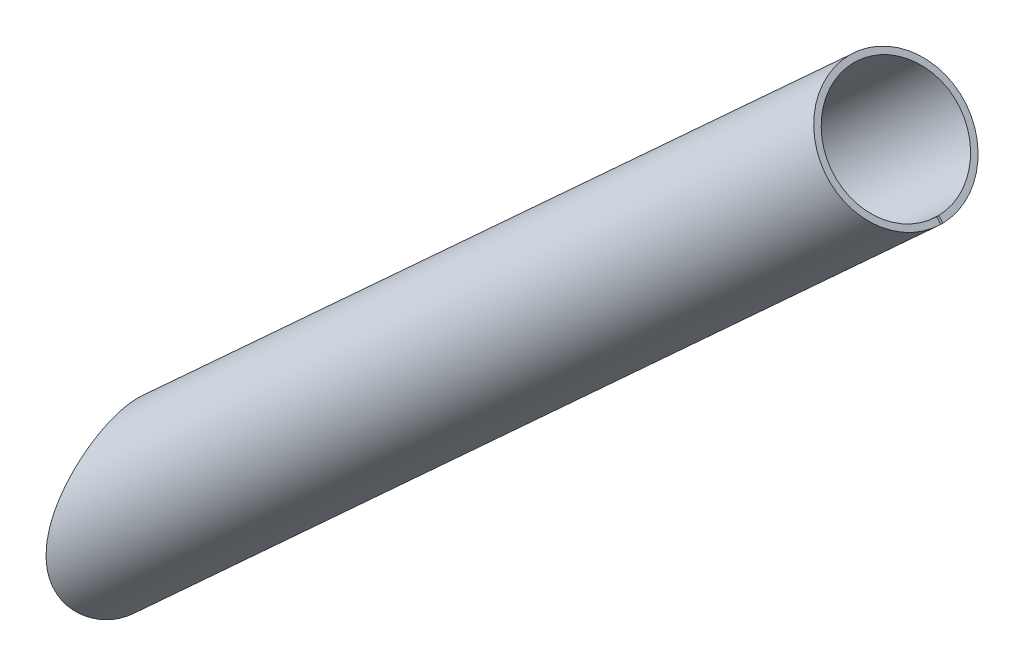
ISO-10303-21;
HEADER;
FILE_DESCRIPTION(('STEP AP214'),'2;1');
FILE_NAME('part.step','',(''),(''),'','','');
FILE_SCHEMA(('AUTOMOTIVE_DESIGN { 1 0 10303 214 1 1 1 1 }'));
ENDSEC;
DATA;
#1=APPLICATION_CONTEXT('core data for automotive mechanical design processes');
#2=APPLICATION_PROTOCOL_DEFINITION('international standard','automotive_design',2000,#1);
#3=PRODUCT_CONTEXT('',#1,'mechanical');
#4=PRODUCT('Part','Part','',(#3));
#5=PRODUCT_RELATED_PRODUCT_CATEGORY('part','',(#4));
#6=PRODUCT_DEFINITION_FORMATION('','',#4);
#7=PRODUCT_DEFINITION_CONTEXT('part definition',#1,'design');
#8=PRODUCT_DEFINITION('design','',#6,#7);
#9=PRODUCT_DEFINITION_SHAPE('','',#8);
#10=(LENGTH_UNIT() NAMED_UNIT(*) SI_UNIT(.MILLI.,.METRE.));
#11=(NAMED_UNIT(*) PLANE_ANGLE_UNIT() SI_UNIT($,.RADIAN.));
#12=(NAMED_UNIT(*) SI_UNIT($,.STERADIAN.) SOLID_ANGLE_UNIT());
#13=UNCERTAINTY_MEASURE_WITH_UNIT(LENGTH_MEASURE(1.E-05),#10,'distance_accuracy_value','');
#14=(GEOMETRIC_REPRESENTATION_CONTEXT(3) GLOBAL_UNCERTAINTY_ASSIGNED_CONTEXT((#13)) GLOBAL_UNIT_ASSIGNED_CONTEXT((#10,
#11,#12)) REPRESENTATION_CONTEXT('',''));
#15=CARTESIAN_POINT('',(0.,0.,0.));
#16=DIRECTION('',(0.,0.,1.));
#17=DIRECTION('',(1.,0.,0.));
#18=AXIS2_PLACEMENT_3D('',#15,#16,#17);
#19=CARTESIAN_POINT('',(-5.55706958739599,323.624691259669,0.));
#20=DIRECTION('',(0.736924102746331,0.675975492744755,0.));
#21=DIRECTION('',(-0.675975492744755,0.736924102746331,0.));
#22=AXIS2_PLACEMENT_3D('',#19,#20,#21);
#23=CYLINDRICAL_SURFACE('',#22,33.);
#24=DIRECTION('',(0.736924102746331,0.675975492744755,0.));
#25=VECTOR('',#24,1.);
#26=CARTESIAN_POINT('',(16.7470232369883,299.30957367243,-0.549999999999997));
#27=LINE('',#26,#25);
#28=CARTESIAN_POINT('',(52.9971461495805,332.561566118567,-0.549999999999997));
#29=VERTEX_POINT('',#28);
#30=CARTESIAN_POINT('',(442.689154624368,690.023408478899,-0.549999999999997));
#31=VERTEX_POINT('',#30);
#32=EDGE_CURVE('E82',#29,#31,#27,.T.);
#33=ORIENTED_EDGE('',*,*,#32,.F.);
#34=CARTESIAN_POINT('',(52.9971461495805,332.561566118567,-0.549999999999984));
#35=CARTESIAN_POINT('',(52.9923899404768,332.567584587994,-1.00927816639076));
#36=CARTESIAN_POINT('',(52.9816444718589,332.581136543743,-1.46839148700775));
#37=CARTESIAN_POINT('',(52.948273791183,332.623322671838,-2.38549185133649));
#38=CARTESIAN_POINT('',(52.9256485855717,332.651956836,-2.8434788956593));
#39=CARTESIAN_POINT('',(52.86861723987,332.724322582206,-3.75753000118988));
#40=CARTESIAN_POINT('',(52.8342111157886,332.768054143734,-4.21359406500992));
#41=CARTESIAN_POINT('',(52.7538031540891,332.870632227236,-5.12296003936136));
#42=CARTESIAN_POINT('',(52.7078013291599,332.92947873267,-5.57626195291478));
#43=CARTESIAN_POINT('',(52.5526778144179,333.128804978602,-6.93123579373183));
#44=CARTESIAN_POINT('',(52.4264504819671,333.292055971123,-7.82777919178433));
#45=CARTESIAN_POINT('',(52.1310190444332,333.679539109368,-9.60023177394968));
#46=CARTESIAN_POINT('',(51.9618157697652,333.903770076794,-10.4761413564081));
#47=CARTESIAN_POINT('',(51.5838529891609,334.413897155692,-12.201920322042));
#48=CARTESIAN_POINT('',(51.3750612418644,334.699843555437,-13.0517678199343));
#49=CARTESIAN_POINT('',(50.9226250212133,335.333807282311,-14.7184209662848));
#50=CARTESIAN_POINT('',(50.6789799843525,335.681825613037,-15.5352260802415));
#51=CARTESIAN_POINT('',(50.1626102425846,336.440262221905,-17.1293369909843));
#52=CARTESIAN_POINT('',(49.8898972702779,336.850655352175,-17.9066585387423));
#53=CARTESIAN_POINT('',(49.3220439408283,337.734236541864,-19.4161323687651));
#54=CARTESIAN_POINT('',(49.0269042024578,338.207422869036,-20.1482858962424));
#55=CARTESIAN_POINT('',(48.4277582533348,339.206812078437,-21.5481045686818));
#56=CARTESIAN_POINT('',(48.1240295838233,339.731827880297,-22.2167352899221));
#57=CARTESIAN_POINT('',(47.5106827780949,340.841346466649,-23.4998021058893));
#58=CARTESIAN_POINT('',(47.2010647392964,341.425848267852,-24.1142390961105));
#59=CARTESIAN_POINT('',(46.5850078391772,342.652030528154,-25.2838640080351));
#60=CARTESIAN_POINT('',(46.2785667637865,343.293667692192,-25.8390961035861));
#61=CARTESIAN_POINT('',(45.6776804211397,344.631275273017,-26.887070112496));
#62=CARTESIAN_POINT('',(45.3832342883854,345.327241759052,-27.3798165399647));
#63=CARTESIAN_POINT('',(44.8345063243371,346.719231667409,-28.2687290245265));
#64=CARTESIAN_POINT('',(44.5788548898414,347.411969878563,-28.6692035016378));
#65=CARTESIAN_POINT('',(44.0916265125637,348.835445591307,-29.4130289628111));
#66=CARTESIAN_POINT('',(43.8600476784545,349.56618010084,-29.7563844358524));
#67=CARTESIAN_POINT('',(43.4258690044705,351.05990104992,-30.3865182944692));
#68=CARTESIAN_POINT('',(43.2232697135639,351.822888100082,-30.6732956083066));
#69=CARTESIAN_POINT('',(42.8504033407546,353.374928612399,-31.192064707679));
#70=CARTESIAN_POINT('',(42.6801404371511,354.163985427677,-31.4240494142093));
#71=CARTESIAN_POINT('',(42.3354729127576,355.961759108018,-31.8874812469867));
#72=CARTESIAN_POINT('',(42.1706635068124,356.976098218477,-32.1043104553048));
#73=CARTESIAN_POINT('',(41.8946961885079,359.024969200358,-32.4636018474673));
#74=CARTESIAN_POINT('',(41.7835521790069,360.059506232221,-32.6060447611599));
#75=CARTESIAN_POINT('',(41.6123122785372,362.141541699802,-32.8242982820131));
#76=CARTESIAN_POINT('',(41.5523136330595,363.18906100168,-32.8999819656347));
#77=CARTESIAN_POINT('',(41.4796128723301,365.288212580653,-32.9915894285157));
#78=CARTESIAN_POINT('',(41.4669132123335,366.339845068424,-33.0075101055224));
#79=CARTESIAN_POINT('',(41.4822254807667,368.22979707635,-32.9882516544969));
#80=CARTESIAN_POINT('',(41.5025371498526,369.068326398635,-32.9627384255679));
#81=CARTESIAN_POINT('',(41.567646860072,370.742994463304,-32.8805947872554));
#82=CARTESIAN_POINT('',(41.6124482513702,371.579132862878,-32.823960120491));
#83=CARTESIAN_POINT('',(41.7240943735313,373.247899881697,-32.6819225410918));
#84=CARTESIAN_POINT('',(41.790951240103,374.080526312509,-32.5965037898706));
#85=CARTESIAN_POINT('',(41.944354595092,375.740704884543,-32.3988695585414));
#86=CARTESIAN_POINT('',(42.0309003422355,376.568257215596,-32.2866550872674));
#87=CARTESIAN_POINT('',(42.2217926762457,378.219930686341,-32.0366200102176));
#88=CARTESIAN_POINT('',(42.3261911974624,379.04403441799,-31.8987245903695));
#89=CARTESIAN_POINT('',(42.5506021636569,380.685674602062,-31.5987552709632));
#90=CARTESIAN_POINT('',(42.6706147181996,381.503211008358,-31.4366812017405));
#91=CARTESIAN_POINT('',(42.924385346729,383.130919603507,-31.0892811170354));
#92=CARTESIAN_POINT('',(43.0581395593307,383.94109379186,-30.903961630264));
#93=CARTESIAN_POINT('',(43.3377526689541,385.55379424343,-30.5106116083632));
#94=CARTESIAN_POINT('',(43.4836116107974,386.356320478316,-30.3025809891378));
#95=CARTESIAN_POINT('',(43.7983850837246,388.019129410478,-29.8460144964778));
#96=CARTESIAN_POINT('',(43.9682089022445,388.878711427048,-29.5955525675377));
#97=CARTESIAN_POINT('',(44.3184747086582,390.587621862418,-29.0684184623632));
#98=CARTESIAN_POINT('',(44.4989168487224,391.436950134063,-28.7917459104714));
#99=CARTESIAN_POINT('',(44.8688304280483,393.124814757592,-28.2118131599871));
#100=CARTESIAN_POINT('',(45.0583047703838,393.96334752816,-27.9085443863441));
#101=CARTESIAN_POINT('',(45.4446712112051,395.628366507757,-27.2748891646955));
#102=CARTESIAN_POINT('',(45.6415632047892,396.454852886919,-26.9445031001092));
#103=CARTESIAN_POINT('',(46.0405004633345,398.091454184181,-26.2569931542658));
#104=CARTESIAN_POINT('',(46.2425229876017,398.901619855046,-25.8999770324529));
#105=CARTESIAN_POINT('',(46.6509885134928,400.507414449627,-25.1568101853827));
#106=CARTESIAN_POINT('',(46.8574317112674,401.303042725384,-24.7706581654028));
#107=CARTESIAN_POINT('',(47.2731054800296,402.877402889077,-23.9678478448557));
#108=CARTESIAN_POINT('',(47.4823342779577,403.656144766499,-23.5512082554646));
#109=CARTESIAN_POINT('',(47.9020942877142,405.194788698942,-22.6852577342128));
#110=CARTESIAN_POINT('',(48.112625299435,405.954693562929,-22.2359517133353));
#111=CARTESIAN_POINT('',(48.5101726617482,407.370460286868,-21.3534746240694));
#112=CARTESIAN_POINT('',(48.6972316633299,408.028581614292,-20.9239527429903));
#113=CARTESIAN_POINT('',(49.069634448829,409.324840256325,-20.0350498159202));
#114=CARTESIAN_POINT('',(49.2549783550759,409.962979004055,-19.5756709185306));
#115=CARTESIAN_POINT('',(49.6226644162038,411.216890915563,-18.6239594563463));
#116=CARTESIAN_POINT('',(49.8050012714385,411.832626508955,-18.131575145912));
#117=CARTESIAN_POINT('',(50.1644687350788,413.036243915344,-17.111935840487));
#118=CARTESIAN_POINT('',(50.3415993248128,413.624125628452,-16.5846807204576));
#119=CARTESIAN_POINT('',(50.6903189525329,414.77284910628,-15.4863581023122));
#120=CARTESIAN_POINT('',(50.861822785699,415.333310390366,-14.9148629582173));
#121=CARTESIAN_POINT('',(51.1942622288778,416.412550654754,-13.7304771806943));
#122=CARTESIAN_POINT('',(51.3551956740776,416.931321101617,-13.117578119567));
#123=CARTESIAN_POINT('',(51.6624637146458,417.916239336219,-11.8496375608802));
#124=CARTESIAN_POINT('',(51.8088366654579,418.382525828826,-11.1947146859669));
#125=CARTESIAN_POINT('',(52.0144033975715,419.034355995491,-10.1794363819578));
#126=CARTESIAN_POINT('',(52.0805786092302,419.243652698624,-9.8356187424328));
#127=CARTESIAN_POINT('',(52.2076939970756,419.644828915911,-9.13689286781235));
#128=CARTESIAN_POINT('',(52.2686331475039,419.836705017738,-8.78198247810535));
#129=CARTESIAN_POINT('',(52.3978276532033,420.242725175304,-7.9792490369939));
#130=CARTESIAN_POINT('',(52.4645842545803,420.451975062303,-7.5286881528609));
#131=CARTESIAN_POINT('',(52.5879049733425,420.83779358088,-6.61254613117696));
#132=CARTESIAN_POINT('',(52.6444724439353,421.014372964728,-6.14696999478372));
#133=CARTESIAN_POINT('',(52.746150402314,421.331297584885,-5.20277081048213));
#134=CARTESIAN_POINT('',(52.7912701120278,421.471671988216,-4.724158610399));
#135=CARTESIAN_POINT('',(52.8689677924635,421.713147080868,-3.75606107825244));
#136=CARTESIAN_POINT('',(52.901545647743,421.814247408689,-3.26657564614937));
#137=CARTESIAN_POINT('',(52.9534189933582,421.975130051795,-2.27657074869768));
#138=CARTESIAN_POINT('',(52.972619487569,422.034616870543,-1.77599790156058));
#139=CARTESIAN_POINT('',(52.9967712503812,422.109431918109,-0.771201860734391));
#140=CARTESIAN_POINT('',(53.001722667995,422.12476060872,-0.266978705274377));
#141=CARTESIAN_POINT('',(52.9972182114836,422.110811438609,0.740827259280468));
#142=CARTESIAN_POINT('',(52.9877609420628,422.0815292579,1.24441000163315));
#143=CARTESIAN_POINT('',(52.9547365925738,421.979200691143,2.246609351602));
#144=CARTESIAN_POINT('',(52.9311697707216,421.906155106001,2.74522604993094));
#145=CARTESIAN_POINT('',(52.873141794114,421.726082880901,3.69288667698761));
#146=CARTESIAN_POINT('',(52.8397384529927,421.622352576725,4.14262967697302));
#147=CARTESIAN_POINT('',(52.7624483811136,421.381994761549,5.03223467370165));
#148=CARTESIAN_POINT('',(52.7185625295956,421.245370009623,5.47209749577929));
#149=CARTESIAN_POINT('',(52.6212241716868,420.941803191183,6.34015621565797));
#150=CARTESIAN_POINT('',(52.5677705088868,420.774857459902,6.76835069595384));
#151=CARTESIAN_POINT('',(52.4522670213592,420.413365183952,7.61190372691264));
#152=CARTESIAN_POINT('',(52.3902128728102,420.218804755035,8.02725569183546));
#153=CARTESIAN_POINT('',(52.2199310267652,419.683631391769,9.08345625273553));
#154=CARTESIAN_POINT('',(52.1059463381779,419.324216914964,9.71389872060429));
#155=CARTESIAN_POINT('',(51.862580475888,418.553241136215,10.9390776436693));
#156=CARTESIAN_POINT('',(51.7331899951232,418.141648302074,11.5337921849191));
#157=CARTESIAN_POINT('',(51.529896214347,417.491476127894,12.3999183902664));
#158=CARTESIAN_POINT('',(51.460500329147,417.268976340136,12.6846574733553));
#159=CARTESIAN_POINT('',(51.3190524877452,416.814183197822,13.2453159701875));
#160=CARTESIAN_POINT('',(51.2470016838077,416.581894085795,13.5212391152854));
#161=CARTESIAN_POINT('',(51.0273131979369,415.871499037211,14.3363250385044));
#162=CARTESIAN_POINT('',(50.8761377761435,415.379860069395,14.8628113214743));
#163=CARTESIAN_POINT('',(50.5868929407805,414.432757300845,15.8171211252353));
#164=CARTESIAN_POINT('',(50.4496845289837,413.980934117351,16.248858673187));
#165=CARTESIAN_POINT('',(50.171135877998,413.057711650178,17.0895651143207));
#166=CARTESIAN_POINT('',(50.0297951070801,412.586309843919,17.49853105754));
#167=CARTESIAN_POINT('',(49.7439909442793,411.626309678357,18.2952060628013));
#168=CARTESIAN_POINT('',(49.5995256133957,411.137700515277,18.6829013646511));
#169=CARTESIAN_POINT('',(49.3084916410092,410.14572677582,19.438013141774));
#170=CARTESIAN_POINT('',(49.1619230750875,409.642362728995,19.805430343466));
#171=CARTESIAN_POINT('',(48.8670733639112,408.621190235866,20.5221763088476));
#172=CARTESIAN_POINT('',(48.7187885492353,408.103344986951,20.8714510155476));
#173=CARTESIAN_POINT('',(48.4216418910171,407.056053522305,21.551853592712));
#174=CARTESIAN_POINT('',(48.2727800490916,406.526607339059,21.8829815139814));
#175=CARTESIAN_POINT('',(47.9751720467595,405.45747109144,22.5279599009921));
#176=CARTESIAN_POINT('',(47.8264258664436,404.917783697727,22.8418147900687));
#177=CARTESIAN_POINT('',(47.529608887704,403.829035102232,23.4531810082122));
#178=CARTESIAN_POINT('',(47.3815381242939,403.279973421333,23.7506914986207));
#179=CARTESIAN_POINT('',(46.9784811155878,401.767472309735,24.5426194095339));
#180=CARTESIAN_POINT('',(46.7247338904833,400.795480588473,25.0214091370521));
#181=CARTESIAN_POINT('',(46.2237434177789,398.829447852113,25.9352446592688));
#182=CARTESIAN_POINT('',(45.976501055138,397.835403870459,26.3702845244746));
#183=CARTESIAN_POINT('',(45.4910386036795,395.827160459954,27.1991954882399));
#184=CARTESIAN_POINT('',(45.2528259914348,394.812945344955,27.5930329266045));
#185=CARTESIAN_POINT('',(44.7884024574271,392.76723068885,28.3406526256104));
#186=CARTESIAN_POINT('',(44.562190937771,391.735732012183,28.6944368826951));
#187=CARTESIAN_POINT('',(44.1248927896117,389.658053174539,29.36244195335));
#188=CARTESIAN_POINT('',(43.9137908705843,388.611889174646,29.6767030144443));
#189=CARTESIAN_POINT('',(43.5096106084232,386.505101352873,30.2661770787905));
#190=CARTESIAN_POINT('',(43.3165331922245,385.44447679055,30.5413880742164));
#191=CARTESIAN_POINT('',(42.952079738574,383.310854665716,31.0518455076404));
#192=CARTESIAN_POINT('',(42.7806863830821,382.237867733372,31.2871238898926));
#193=CARTESIAN_POINT('',(42.4634003508006,380.080059450279,31.716413129922));
#194=CARTESIAN_POINT('',(42.3175039428909,378.9952398558,31.9104300266409));
#195=CARTESIAN_POINT('',(42.044144708404,376.719282043123,32.2698832724143));
#196=CARTESIAN_POINT('',(41.9194246669756,375.527171033276,32.4313151379848));
#197=CARTESIAN_POINT('',(41.7119003489866,373.132902906733,32.6977987519091));
#198=CARTESIAN_POINT('',(41.629095443568,371.930745941031,32.8028513461297));
#199=CARTESIAN_POINT('',(41.5127105574785,369.522147751133,32.9500200307383));
#200=CARTESIAN_POINT('',(41.4790440546643,368.31571781589,32.992246746512));
#201=CARTESIAN_POINT('',(41.4682640853799,365.902086652398,33.0058143785936));
#202=CARTESIAN_POINT('',(41.4911381152958,364.694885653691,32.9771709674215));
#203=CARTESIAN_POINT('',(41.5891432199387,362.540184233351,32.8534255300312));
#204=CARTESIAN_POINT('',(41.6523188152601,361.591275550594,32.773508421151));
#205=CARTESIAN_POINT('',(41.8213660533495,359.703580727891,32.5575250500125));
#206=CARTESIAN_POINT('',(41.9272337303122,358.764793656031,32.4214640031187));
#207=CARTESIAN_POINT('',(42.1832253476395,356.905045721944,32.0876878569264));
#208=CARTESIAN_POINT('',(42.3333130849982,355.984070931512,31.8900231849534));
#209=CARTESIAN_POINT('',(42.6776528649477,354.167204746702,31.4277126281183));
#210=CARTESIAN_POINT('',(42.8719040205873,353.27131284898,31.1630680884272));
#211=CARTESIAN_POINT('',(43.1953316915398,351.949141070472,30.7115233690151));
#212=CARTESIAN_POINT('',(43.3091288881794,351.509902348243,30.5509768394317));
#213=CARTESIAN_POINT('',(43.5466426862997,350.641355857269,30.211469985766));
#214=CARTESIAN_POINT('',(43.6703580337777,350.212046841877,30.0325119887319));
#215=CARTESIAN_POINT('',(43.9269702276822,349.364426521921,29.6559130319015));
#216=CARTESIAN_POINT('',(44.0598685375485,348.946116985019,29.4582690923693));
#217=CARTESIAN_POINT('',(44.3338790196806,348.121697650391,29.044255577908));
#218=CARTESIAN_POINT('',(44.4749901296389,347.715586285116,28.8278884230308));
#219=CARTESIAN_POINT('',(44.7643925588189,346.916446686816,28.3764171612501));
#220=CARTESIAN_POINT('',(44.9126851216735,346.52342073986,28.1413098044657));
#221=CARTESIAN_POINT('',(45.2152153763009,345.751476807602,27.6526105796894));
#222=CARTESIAN_POINT('',(45.3694523403706,345.372557106532,27.3990209708969));
#223=CARTESIAN_POINT('',(45.6826081611304,344.629559016255,26.8736450630472));
#224=CARTESIAN_POINT('',(45.841526946693,344.265480401778,26.601859040355));
#225=CARTESIAN_POINT('',(46.1626899384807,343.552852469802,26.0405580331767));
#226=CARTESIAN_POINT('',(46.324934034992,343.204302641154,25.7510436329879));
#227=CARTESIAN_POINT('',(46.7685565338551,342.278829336615,24.9407821257471));
#228=CARTESIAN_POINT('',(47.0518961590308,341.717467540337,24.4031586254889));
#229=CARTESIAN_POINT('',(47.6173999976622,340.644148716258,23.2804272840452));
#230=CARTESIAN_POINT('',(47.8995643450567,340.132185902711,22.6953250185166));
#231=CARTESIAN_POINT('',(48.4562049935606,339.158478851702,21.4812039889116));
#232=CARTESIAN_POINT('',(48.7306804095204,338.696740378568,20.8521801974658));
#233=CARTESIAN_POINT('',(49.2658137639534,337.823965727737,19.5543431585032));
#234=CARTESIAN_POINT('',(49.526471008172,337.412932096187,18.8855279153549));
#235=CARTESIAN_POINT('',(50.0380651128197,336.626877690752,17.4862181946586));
#236=CARTESIAN_POINT('',(50.2882537883594,336.253824450861,16.7543447909956));
#237=CARTESIAN_POINT('',(50.7625313851488,335.562078754105,15.2571971247256));
#238=CARTESIAN_POINT('',(50.9866190320858,335.243388951038,14.4919212338372));
#239=CARTESIAN_POINT('',(51.4041725647353,334.659988862315,12.932990729131));
#240=CARTESIAN_POINT('',(51.5976384383778,334.395278597937,12.1393361041277));
#241=CARTESIAN_POINT('',(51.9502135209996,333.919442098427,10.5287550073207));
#242=CARTESIAN_POINT('',(52.1093267166641,333.708309645002,9.71183124840732));
#243=CARTESIAN_POINT('',(52.3651376881741,333.372265268304,8.20767290103235));
#244=CARTESIAN_POINT('',(52.4679091909847,333.238685714658,7.52338450407314));
#245=CARTESIAN_POINT('',(52.6470886135391,333.007217429099,6.14545731132823));
#246=CARTESIAN_POINT('',(52.7234995530786,332.909324608936,5.45181959604139));
#247=CARTESIAN_POINT('',(52.8489872317181,332.749174227522,4.05870272519651));
#248=CARTESIAN_POINT('',(52.8980931733603,332.686878593298,3.35923062556738));
#249=CARTESIAN_POINT('',(52.9509163290254,332.619982596295,2.30734957712072));
#250=CARTESIAN_POINT('',(52.9650518752484,332.602107944756,1.95623399623513));
#251=CARTESIAN_POINT('',(52.986342248369,332.575204724973,1.25345185474485));
#252=CARTESIAN_POINT('',(52.9934970584769,332.566176178005,0.901785292816995));
#253=CARTESIAN_POINT('',(52.9971461495805,332.561566118567,0.549999999999973));
#254=B_SPLINE_CURVE_WITH_KNOTS('',3,(#34,#35,#36,#37,#38,#39,#40,#41,#42,#43,#44,#45,#46,#47,
#48,#49,#50,#51,#52,#53,#54,#55,#56,#57,#58,#59,#60,#61,#62,#63,#64,#65,#66,#67,#68,#69,#70,#71,
#72,#73,#74,#75,#76,#77,#78,#79,#80,#81,#82,#83,#84,#85,#86,#87,#88,#89,#90,#91,#92,#93,#94,#95,
#96,#97,#98,#99,#100,#101,#102,#103,#104,#105,#106,#107,#108,#109,#110,#111,#112,#113,#114,#115,
#116,#117,#118,#119,#120,#121,#122,#123,#124,#125,#126,#127,#128,#129,#130,#131,#132,#133,#134,
#135,#136,#137,#138,#139,#140,#141,#142,#143,#144,#145,#146,#147,#148,#149,#150,#151,#152,#153,
#154,#155,#156,#157,#158,#159,#160,#161,#162,#163,#164,#165,#166,#167,#168,#169,#170,#171,#172,
#173,#174,#175,#176,#177,#178,#179,#180,#181,#182,#183,#184,#185,#186,#187,#188,#189,#190,#191,
#192,#193,#194,#195,#196,#197,#198,#199,#200,#201,#202,#203,#204,#205,#206,#207,#208,#209,#210,
#211,#212,#213,#214,#215,#216,#217,#218,#219,#220,#221,#222,#223,#224,#225,#226,#227,#228,#229,
#230,#231,#232,#233,#234,#235,#236,#237,#238,#239,#240,#241,#242,#243,#244,#245,#246,#247,#248,
#249,#250,#251,#252,#253),.UNSPECIFIED.,.F.,.F.,(4,2,2,2,2,2,2,2,2,2,2,2,2,2,2,2,2,2,2,2,2,2,2,
2,2,2,2,2,2,2,2,2,2,2,2,2,2,2,2,2,2,2,2,2,2,2,2,2,2,2,2,2,2,2,2,2,2,2,2,2,2,2,2,2,2,2,2,2,2,2,2,
2,2,2,2,2,2,2,2,2,2,2,2,2,2,2,2,2,2,2,2,2,2,2,2,2,2,2,2,2,2,2,2,2,2,2,2,2,2,4),(0.,
1.37791807709412,2.75583540644283,4.13375086335472,5.51166481243815,8.2680837264345,
11.0244493827759,13.7830695764733,16.5417343764352,19.2992898916313,22.0567693512791,
24.7615095556484,27.4662050586522,30.1688682066195,32.8713359965567,35.3882416156933,
37.9049493378201,40.4217047283943,42.9387850969312,46.0848002040764,49.2316298988213,
52.384429572538,55.5373929034523,58.0539259047851,60.570803250999,63.0890677891937,
65.6072375320163,68.1328613694988,70.6585029304314,73.1834367210263,75.7083798614112,
78.4417455592935,81.1751504383902,83.9094398742404,86.6436906558331,89.3674218833163,
92.0912742176204,94.8134686373125,97.5352546525235,99.9580582098913,102.380687607602,
104.807208278872,107.233737651545,109.68767853818,112.142120434302,114.589915357439,
115.81319636428,117.0367164713,118.539138659408,120.041065498603,121.541778567277,
123.042505449053,124.553783650134,126.065046046682,127.576454798811,129.087835891808,
130.474668184765,131.86138419546,133.248267924269,134.635851443526,136.836117656935,
139.037719921249,140.141405862467,141.244618306954,143.451016372789,145.36974924481,
147.288730104805,149.208938079571,151.129077222345,153.054643132402,154.980203651239,
156.905268749494,158.830432533986,162.16763694608,165.505293047289,168.845654886862,
172.185850153357,175.522615984168,178.859553318388,182.193808544377,185.527575439653,
189.154018661893,192.780407474543,196.400403262181,200.019598580169,202.880357020449,
205.740849776832,208.599007121939,211.457107070616,212.900562648857,214.343836010563,
215.787339911914,217.230657512399,218.674225956398,220.117618239139,221.560988604787,
223.004311424971,225.483134147334,227.961666189892,230.440482398059,232.919423029444,
235.492766510702,238.06623557595,240.639705655559,243.212876918974,245.32567987279,
247.438240709106,249.548537806269,250.603944398757,251.659353529645),.UNSPECIFIED.);
#255=CARTESIAN_POINT('',(52.9971461495805,332.561566118567,0.54999999999998));
#256=VERTEX_POINT('',#255);
#257=EDGE_CURVE('E126',#29,#256,#254,.T.);
#258=ORIENTED_EDGE('',*,*,#257,.T.);
#259=DIRECTION('',(0.736924102746331,0.675975492744755,0.));
#260=VECTOR('',#259,1.);
#261=CARTESIAN_POINT('',(16.7470232369883,299.30957367243,0.54999999999998));
#262=LINE('',#261,#260);
#263=CARTESIAN_POINT('',(442.689154624368,690.023408478899,0.54999999999998));
#264=VERTEX_POINT('',#263);
#265=EDGE_CURVE('E115',#256,#264,#262,.T.);
#266=ORIENTED_EDGE('',*,*,#265,.T.);
#267=CARTESIAN_POINT('',(420.385061799983,714.338526066137,0.));
#268=DIRECTION('',(0.736924102746331,0.675975492744755,0.));
#269=DIRECTION('',(0.,0.,-1.));
#270=AXIS2_PLACEMENT_3D('',#267,#268,#269);
#271=CIRCLE('',#270,33.);
#272=EDGE_CURVE('E128',#31,#264,#271,.T.);
#273=ORIENTED_EDGE('',*,*,#272,.F.);
#274=EDGE_LOOP('',(#33,#258,#266,#273));
#275=FACE_BOUND('',#274,.T.);
#276=ADVANCED_FACE('F74',(#275),#23,.T.);
#277=CARTESIAN_POINT('',(16.7470232369883,299.30957367243,-0.549999999999997));
#278=DIRECTION('',(-0.0112662582124119,0.0122820683791047,-0.99986110146471));
#279=DIRECTION('',(0.,0.999924562978041,0.0122828479260288));
#280=AXIS2_PLACEMENT_3D('',#277,#278,#279);
#281=PLANE('',#280);
#282=CARTESIAN_POINT('',(0.,328.72215358796,0.));
#283=DIRECTION('',(-0.0112662582124119,0.0122820683791047,-0.99986110146471));
#284=DIRECTION('',(-0.000138383391647361,-0.999924572553516,-0.0122812887640476));
#285=AXIS2_PLACEMENT_3D('',#282,#283,#284);
#286=ELLIPSE('',#285,4315.23407654756,53.);
#287=CARTESIAN_POINT('',(52.9976414569555,336.632430552043,-0.499999999999999));
#288=VERTEX_POINT('',#287);
#289=EDGE_CURVE('E89',#29,#288,#286,.F.);
#290=ORIENTED_EDGE('',*,*,#289,.F.);
#291=ORIENTED_EDGE('',*,*,#32,.T.);
#292=DIRECTION('',(-0.675881600738921,0.736821745067839,0.0166666666666656));
#293=VECTOR('',#292,1.);
#294=CARTESIAN_POINT('',(442.689154624368,690.023408478899,-0.549999999999997));
#295=LINE('',#294,#293);
#296=CARTESIAN_POINT('',(440.661509822151,692.233873714102,-0.499999999999999));
#297=VERTEX_POINT('',#296);
#298=EDGE_CURVE('E124',#31,#297,#295,.T.);
#299=ORIENTED_EDGE('',*,*,#298,.T.);
#300=DIRECTION('',(0.736924102746331,0.675975492744755,0.));
#301=VECTOR('',#300,1.);
#302=CARTESIAN_POINT('',(14.7193784347716,301.520038907634,-0.499999999999999));
#303=LINE('',#302,#301);
#304=EDGE_CURVE('E160',#288,#297,#303,.T.);
#305=ORIENTED_EDGE('',*,*,#304,.F.);
#306=EDGE_LOOP('',(#290,#291,#299,#305));
#307=FACE_BOUND('',#306,.T.);
#308=ADVANCED_FACE('F165',(#307),#281,.F.);
#309=CARTESIAN_POINT('',(-5.55706958739593,323.624691259669,0.));
#310=DIRECTION('',(0.736924102746331,0.675975492744755,0.));
#311=DIRECTION('',(-0.675975492744755,0.736924102746331,0.));
#312=AXIS2_PLACEMENT_3D('',#309,#310,#311);
#313=CYLINDRICAL_SURFACE('',#312,30.);
#314=CARTESIAN_POINT('',(52.9976414569554,336.632430552043,-0.499999999999999));
#315=CARTESIAN_POINT('',(52.9937515532173,336.638202920373,-0.913246348444982));
#316=CARTESIAN_POINT('',(52.9850117429704,336.651128697514,-1.32634356971868));
#317=CARTESIAN_POINT('',(52.95791829088,336.691295479516,-2.1515258703707));
#318=CARTESIAN_POINT('',(52.9395646413704,336.718536495793,-2.56361094894168));
#319=CARTESIAN_POINT('',(52.8933291523886,336.787342672292,-3.38606057476392));
#320=CARTESIAN_POINT('',(52.865447170203,336.82890804706,-3.79642509615185));
#321=CARTESIAN_POINT('',(52.8003156277492,336.926368019475,-4.6146730679789));
#322=CARTESIAN_POINT('',(52.7630660802751,336.982262597552,-5.02255652180586));
#323=CARTESIAN_POINT('',(52.6375031360264,337.171535292853,-6.24182863509907));
#324=CARTESIAN_POINT('',(52.5353884924358,337.326483260187,-7.04860946547127));
#325=CARTESIAN_POINT('',(52.2966400030605,337.693955977508,-8.64361158522922));
#326=CARTESIAN_POINT('',(52.1600069781451,337.906479358324,-9.43183331547519));
#327=CARTESIAN_POINT('',(51.8551669479736,338.389484403741,-10.9849145498714));
#328=CARTESIAN_POINT('',(51.6869308867578,338.660019437144,-11.7497517957419));
#329=CARTESIAN_POINT('',(51.3229233914794,339.258988791617,-13.2496466285787));
#330=CARTESIAN_POINT('',(51.1271515675558,339.587423932474,-13.9847037937182));
#331=CARTESIAN_POINT('',(50.7130051739038,340.301841844421,-15.419079552478));
#332=CARTESIAN_POINT('',(50.4946443252877,340.68778974293,-16.1184194604233));
#333=CARTESIAN_POINT('',(50.0408366586637,341.516890338305,-17.4764769276831));
#334=CARTESIAN_POINT('',(49.8053903155093,341.960041445602,-18.1351956150338));
#335=CARTESIAN_POINT('',(49.3282820810422,342.89364579532,-19.3949943195411));
#336=CARTESIAN_POINT('',(49.0868204042828,343.383052510168,-19.9969254447474));
#337=CARTESIAN_POINT('',(48.6000679400946,344.414236667128,-21.1524590659843));
#338=CARTESIAN_POINT('',(48.3547772275092,344.956013086681,-21.7060625052491));
#339=CARTESIAN_POINT('',(47.8672576706248,346.089088193653,-22.7610039596642));
#340=CARTESIAN_POINT('',(47.6250276213754,346.680366646202,-23.262363144314));
#341=CARTESIAN_POINT('',(47.1502547907284,347.908972395541,-24.2102167710889));
#342=CARTESIAN_POINT('',(46.9177116966692,348.546298204262,-24.6567129849106));
#343=CARTESIAN_POINT('',(46.4782741333828,349.833816719436,-25.4750158791841));
#344=CARTESIAN_POINT('',(46.2707052739451,350.482259870084,-25.8492181626412));
#345=CARTESIAN_POINT('',(45.8748527904345,351.812134022307,-26.5454011137986));
#346=CARTESIAN_POINT('',(45.6865680712105,352.493563147361,-26.8673847476151));
#347=CARTESIAN_POINT('',(45.3329425448487,353.884260760602,-27.4598523186448));
#348=CARTESIAN_POINT('',(45.1676049815199,354.593533166573,-27.7303289768405));
#349=CARTESIAN_POINT('',(44.8624144855683,356.034465461621,-28.2213965975854));
#350=CARTESIAN_POINT('',(44.7225649900539,356.766128354578,-28.4419808330239));
#351=CARTESIAN_POINT('',(44.4296902699543,358.481439874696,-28.8980687151839));
#352=CARTESIAN_POINT('',(44.2865429599647,359.471440300887,-29.1161333998309));
#353=CARTESIAN_POINT('',(44.0474155970151,361.47067899868,-29.4766286598512));
#354=CARTESIAN_POINT('',(43.9514498006363,362.47992298943,-29.619036375416));
#355=CARTESIAN_POINT('',(43.8046677832518,364.510604761824,-29.8356844300596));
#356=CARTESIAN_POINT('',(43.7539337101678,365.532061329013,-29.9098007493656));
#357=CARTESIAN_POINT('',(43.694565963216,367.578677895618,-29.9964585636613));
#358=CARTESIAN_POINT('',(43.6859340524314,368.603838048329,-30.0089974800168));
#359=CARTESIAN_POINT('',(43.7043368996059,370.418745717896,-29.9821748320658));
#360=CARTESIAN_POINT('',(43.7236769676724,371.208791797922,-29.9540113621831));
#361=CARTESIAN_POINT('',(43.783057538893,372.786504272509,-29.8671505791725));
#362=CARTESIAN_POINT('',(43.8231005502019,373.574170367104,-29.8084495664259));
#363=CARTESIAN_POINT('',(43.9219876855983,375.146027804514,-29.6625474863303));
#364=CARTESIAN_POINT('',(43.9808411796688,375.930217217708,-29.5753322148017));
#365=CARTESIAN_POINT('',(44.1154864897382,377.493636600306,-29.3741126610686));
#366=CARTESIAN_POINT('',(44.1912777480372,378.272866732132,-29.2601092608948));
#367=CARTESIAN_POINT('',(44.3583142471182,379.827981648167,-29.0062597494909));
#368=CARTESIAN_POINT('',(44.449607716923,380.60384799638,-28.8663328599303));
#369=CARTESIAN_POINT('',(44.645830934689,382.148996463251,-28.5619076797355));
#370=CARTESIAN_POINT('',(44.7507607720485,382.918278538708,-28.3974092280122));
#371=CARTESIAN_POINT('',(44.9726923892479,384.449381532993,-28.0446137053964));
#372=CARTESIAN_POINT('',(45.0896909836947,385.211204362765,-27.8563229112497));
#373=CARTESIAN_POINT('',(45.3343562355226,386.726948615277,-27.4563490952657));
#374=CARTESIAN_POINT('',(45.4620229301162,387.480870010445,-27.2446659918304));
#375=CARTESIAN_POINT('',(45.7351048337785,389.027812546592,-26.7838835191164));
#376=CARTESIAN_POINT('',(45.881132404863,389.820272232299,-26.5332609806093));
#377=CARTESIAN_POINT('',(46.1822368209697,391.39463301567,-26.0056393390151));
#378=CARTESIAN_POINT('',(46.3373137955112,392.176533962015,-25.7286398583736));
#379=CARTESIAN_POINT('',(46.6551432352339,393.729083325075,-25.1477096118911));
#380=CARTESIAN_POINT('',(46.817898914666,394.499726849541,-24.8437675204316));
#381=CARTESIAN_POINT('',(47.1496211381173,396.028195688151,-24.2082984415226));
#382=CARTESIAN_POINT('',(47.3185875709755,396.78602123136,-23.8767719476494));
#383=CARTESIAN_POINT('',(47.6605585199156,398.283960008885,-23.1866088349921));
#384=CARTESIAN_POINT('',(47.8335411459167,399.02413818173,-22.828102532141));
#385=CARTESIAN_POINT('',(48.1828824770781,400.48854714931,-22.0812104737985));
#386=CARTESIAN_POINT('',(48.3592413949053,401.212776933263,-21.6928228314487));
#387=CARTESIAN_POINT('',(48.7136805691633,402.642318745273,-20.8847278430324));
#388=CARTESIAN_POINT('',(48.8917592536557,403.347646167045,-20.465047104521));
#389=CARTESIAN_POINT('',(49.2481186628981,404.736938882192,-19.5919667948726));
#390=CARTESIAN_POINT('',(49.4263993365234,405.420908694522,-19.1385744262092));
#391=CARTESIAN_POINT('',(49.7505664642334,406.647385417362,-18.2771591372245));
#392=CARTESIAN_POINT('',(49.8967119607569,407.193864333581,-17.874892625248));
#393=CARTESIAN_POINT('',(50.186664895704,408.266914077739,-17.0438369769225));
#394=CARTESIAN_POINT('',(50.3304725353573,408.793486624333,-16.6150501387235));
#395=CARTESIAN_POINT('',(50.614553914977,409.824098871244,-15.7284443456705));
#396=CARTESIAN_POINT('',(50.754822150525,410.328104317514,-15.2705836483686));
#397=CARTESIAN_POINT('',(51.0299194891957,411.308450071409,-14.3244559589519));
#398=CARTESIAN_POINT('',(51.1647484967471,411.784789892993,-13.83618843295));
#399=CARTESIAN_POINT('',(51.4285505177112,412.710039036472,-12.8211752529726));
#400=CARTESIAN_POINT('',(51.5574312372935,413.158539466179,-12.294030572468));
#401=CARTESIAN_POINT('',(51.8050290194727,414.014721852893,-11.2049440798539));
#402=CARTESIAN_POINT('',(51.9237444439467,414.422397232787,-10.6429966843862));
#403=CARTESIAN_POINT('',(52.1476507864416,415.187216107385,-9.48520982965132));
#404=CARTESIAN_POINT('',(52.2528780201334,415.544495560752,-8.88946788380953));
#405=CARTESIAN_POINT('',(52.4466653464563,416.199661009878,-7.66364722593714));
#406=CARTESIAN_POINT('',(52.5352366979214,416.497587134707,-7.03359208272747));
#407=CARTESIAN_POINT('',(52.6644112461245,416.930712922144,-5.96972326545824));
#408=CARTESIAN_POINT('',(52.7109271925092,417.086285589831,-5.54485931617622));
#409=CARTESIAN_POINT('',(52.7944061736326,417.365014390901,-4.68375893893008));
#410=CARTESIAN_POINT('',(52.8313721409317,417.488180475752,-4.24752604749074));
#411=CARTESIAN_POINT('',(52.8948361961781,417.699385306942,-3.36620305225547));
#412=CARTESIAN_POINT('',(52.9213422505748,417.787450787019,-2.92111996136831));
#413=CARTESIAN_POINT('',(52.9632153813975,417.926478696399,-2.02463125372981));
#414=CARTESIAN_POINT('',(52.9785822749018,417.977440516404,-1.5732255332755));
#415=CARTESIAN_POINT('',(52.9977688400384,418.041059150405,-0.665749033599303));
#416=CARTESIAN_POINT('',(53.0015447839616,418.053570908916,-0.209667085458213));
#417=CARTESIAN_POINT('',(52.9973126123995,418.039542494692,0.701836432256518));
#418=CARTESIAN_POINT('',(52.9893045043105,418.013002346468,1.15725800224446));
#419=CARTESIAN_POINT('',(52.9617364567645,417.921558979098,2.06406460462645));
#420=CARTESIAN_POINT('',(52.9421712089109,417.856638131012,2.51544768529373));
#421=CARTESIAN_POINT('',(52.8920406919401,417.69007134245,3.4107307906566));
#422=CARTESIAN_POINT('',(52.8614752527207,417.588424834062,3.85463069952454));
#423=CARTESIAN_POINT('',(52.791515091622,417.35534381782,4.71542821817247));
#424=CARTESIAN_POINT('',(52.7525033046776,417.225199083595,5.1327089029675));
#425=CARTESIAN_POINT('',(52.6658847740791,416.935608710876,5.95617990196626));
#426=CARTESIAN_POINT('',(52.618274915993,416.776152454655,6.36236613590842));
#427=CARTESIAN_POINT('',(52.5153860555509,416.430665550359,7.16217935507628));
#428=CARTESIAN_POINT('',(52.4601077812354,416.244637424971,7.55580752820758));
#429=CARTESIAN_POINT('',(52.342785417011,415.848641092472,8.32983307302474));
#430=CARTESIAN_POINT('',(52.2807395795725,415.638666701283,8.71022699373871));
#431=CARTESIAN_POINT('',(52.1044299135201,415.040004257609,9.72369436301891));
#432=CARTESIAN_POINT('',(51.9844675661469,414.630606971073,10.343621936513));
#433=CARTESIAN_POINT('',(51.7312695338899,413.760472482106,11.5434947845676));
#434=CARTESIAN_POINT('',(51.5980256910768,413.299703704778,12.1234151107465));
#435=CARTESIAN_POINT('',(51.3213019196461,412.335085582206,13.2460942731685));
#436=CARTESIAN_POINT('',(51.1777965017015,411.831128296189,13.7887535107143));
#437=CARTESIAN_POINT('',(50.8836482451898,410.788733134918,14.8374843870337));
#438=CARTESIAN_POINT('',(50.7330060565548,410.250298397896,15.343559346906));
#439=CARTESIAN_POINT('',(50.4456017590103,409.212531423916,16.2617138455725));
#440=CARTESIAN_POINT('',(50.3094001421657,408.716489933884,16.6777132397491));
#441=CARTESIAN_POINT('',(50.034492375804,407.705404079451,17.4851794123525));
#442=CARTESIAN_POINT('',(49.8957858290932,407.190356687634,17.8766422553602));
#443=CARTESIAN_POINT('',(49.6169073257754,406.143564457698,18.6366964183784));
#444=CARTESIAN_POINT('',(49.4767344945001,405.6118092236,19.0052730559853));
#445=CARTESIAN_POINT('',(49.1959812905471,404.534004341011,19.7206247335924));
#446=CARTESIAN_POINT('',(49.0554009363939,403.987955333479,20.0674007488077));
#447=CARTESIAN_POINT('',(48.7742779685518,402.881613947569,20.7413474114648));
#448=CARTESIAN_POINT('',(48.6337366638747,402.321284632252,21.0684578503174));
#449=CARTESIAN_POINT('',(48.3538963060384,401.18931612217,21.7030168833903));
#450=CARTESIAN_POINT('',(48.2145972539348,400.617676917795,22.0104654609056));
#451=CARTESIAN_POINT('',(47.93801340056,399.464379986382,22.6065208154568));
#452=CARTESIAN_POINT('',(47.8007281036332,398.882724803935,22.8951322914074));
#453=CARTESIAN_POINT('',(47.5288356055246,397.710196163425,23.4543475656787));
#454=CARTESIAN_POINT('',(47.3942285120449,397.119322336337,23.7249506408263));
#455=CARTESIAN_POINT('',(47.065421608093,395.647327919357,24.3728032463966));
#456=CARTESIAN_POINT('',(46.8731881523487,394.761267761231,24.7398705929967));
#457=CARTESIAN_POINT('',(46.4981857577847,392.972947360925,25.4376795082004));
#458=CARTESIAN_POINT('',(46.3154175936213,392.070685800906,25.7684181060696));
#459=CARTESIAN_POINT('',(45.9614553028161,390.25106422003,26.3945834226346));
#460=CARTESIAN_POINT('',(45.7902688872684,389.333694635907,26.6899867137631));
#461=CARTESIAN_POINT('',(45.4619457097491,387.485871482499,27.2454685189377));
#462=CARTESIAN_POINT('',(45.3048084567731,386.555418371786,27.5055482676722));
#463=CARTESIAN_POINT('',(45.0074375450207,384.684853922231,27.9894805421687));
#464=CARTESIAN_POINT('',(44.8671647714433,383.744770643867,28.2134173268047));
#465=CARTESIAN_POINT('',(44.6057953371124,381.853938031647,28.6248568327879));
#466=CARTESIAN_POINT('',(44.4846997596256,380.903188098508,28.8123574960955));
#467=CARTESIAN_POINT('',(44.2647523663774,378.993184954644,29.1491361640821));
#468=CARTESIAN_POINT('',(44.1658817854408,378.033939633589,29.2984464287625));
#469=CARTESIAN_POINT('',(43.9934956835195,376.107887848856,29.5566651956579));
#470=CARTESIAN_POINT('',(43.919975576969,375.141082785027,29.6655810049658));
#471=CARTESIAN_POINT('',(43.7977671085661,373.136624586203,29.8457430178855));
#472=CARTESIAN_POINT('',(43.7510758556657,372.09857029681,29.9139713863142));
#473=CARTESIAN_POINT('',(43.6949170757299,370.01923151968,29.9959469931941));
#474=CARTESIAN_POINT('',(43.6854471984261,368.97794724005,30.0096976715292));
#475=CARTESIAN_POINT('',(43.7080998301757,366.898281314978,29.9767002640248));
#476=CARTESIAN_POINT('',(43.7401560404112,365.859897688717,29.930048614082));
#477=CARTESIAN_POINT('',(43.849664287972,363.790651560074,29.7693933825575));
#478=CARTESIAN_POINT('',(43.9271085189733,362.759787795205,29.6554013828726));
#479=CARTESIAN_POINT('',(44.1126479628602,360.889520848519,29.3785076519924));
#480=CARTESIAN_POINT('',(44.2131979261899,360.047632823548,29.2273633091816));
#481=CARTESIAN_POINT('',(44.447768348135,358.380445749613,28.8693927044277));
#482=CARTESIAN_POINT('',(44.5817856369023,357.555145137572,28.6625717157375));
#483=CARTESIAN_POINT('',(44.8823894383519,355.928135721208,28.1895291968575));
#484=CARTESIAN_POINT('',(45.0489607007693,355.126416071677,27.9233354722585));
#485=CARTESIAN_POINT('',(45.4122236615529,353.553403720305,27.328579643881));
#486=CARTESIAN_POINT('',(45.6089152650378,352.782110922627,27.0000177365659));
#487=CARTESIAN_POINT('',(46.0295218427129,351.27239496738,26.2765892264707));
#488=CARTESIAN_POINT('',(46.2536055046184,350.534218129639,25.8813054091592));
#489=CARTESIAN_POINT('',(46.7219387262063,349.103116390363,25.0259453048528));
#490=CARTESIAN_POINT('',(46.9661887469979,348.410192524198,24.5658675361567));
#491=CARTESIAN_POINT('',(47.4675352145892,347.07555048225,23.5825673158455));
#492=CARTESIAN_POINT('',(47.7246332763431,346.433838770117,23.059336914406));
#493=CARTESIAN_POINT('',(48.2435411518337,345.206452835049,21.9529891432154));
#494=CARTESIAN_POINT('',(48.5053506543618,344.620774926893,21.3698757170769));
#495=CARTESIAN_POINT('',(48.9986124051296,343.566094483147,20.2111517650584));
#496=CARTESIAN_POINT('',(49.2304141645163,343.091287798864,19.6409534918603));
#497=CARTESIAN_POINT('',(49.6854048549707,342.191013426602,18.4597124829622));
#498=CARTESIAN_POINT('',(49.9085944452013,341.765541957561,17.8486728830167));
#499=CARTESIAN_POINT('',(50.341092567319,340.964761569045,16.5896815189557));
#500=CARTESIAN_POINT('',(50.5503971583814,340.589466860254,15.9417193717056));
#501=CARTESIAN_POINT('',(50.9502638425782,339.889663744584,14.6134081255001));
#502=CARTESIAN_POINT('',(51.140825630171,339.565156165577,13.9330584988382));
#503=CARTESIAN_POINT('',(51.5039392836416,338.958909144964,12.5254490047799));
#504=CARTESIAN_POINT('',(51.6758538590314,338.678586778923,11.7974143219943));
#505=CARTESIAN_POINT('',(51.991683002769,338.171721517149,10.3168751989984));
#506=CARTESIAN_POINT('',(52.1355942717634,337.945184957776,9.56436788759538));
#507=CARTESIAN_POINT('',(52.3921877381663,337.546026346361,8.04082420958785));
#508=CARTESIAN_POINT('',(52.5049009787989,337.373350678806,7.26980709739426));
#509=CARTESIAN_POINT('',(52.6969205999753,337.081530097165,5.71390333707997));
#510=CARTESIAN_POINT('',(52.7762405449921,336.962363446218,4.92902245572665));
#511=CARTESIAN_POINT('',(52.8853603955248,336.799135865134,3.53624984326266));
#512=CARTESIAN_POINT('',(52.9224220886584,336.743998231899,2.93018979616083));
#513=CARTESIAN_POINT('',(52.9756941386458,336.664924473245,1.71620418369195));
#514=CARTESIAN_POINT('',(52.9919412742968,336.640933311792,1.10828381670328));
#515=CARTESIAN_POINT('',(52.9976414569554,336.632430552043,0.499999999999974));
#516=B_SPLINE_CURVE_WITH_KNOTS('',3,(#314,#315,#316,#317,#318,#319,#320,#321,#322,#323,#324,
#325,#326,#327,#328,#329,#330,#331,#332,#333,#334,#335,#336,#337,#338,#339,#340,#341,#342,#343,
#344,#345,#346,#347,#348,#349,#350,#351,#352,#353,#354,#355,#356,#357,#358,#359,#360,#361,#362,
#363,#364,#365,#366,#367,#368,#369,#370,#371,#372,#373,#374,#375,#376,#377,#378,#379,#380,#381,
#382,#383,#384,#385,#386,#387,#388,#389,#390,#391,#392,#393,#394,#395,#396,#397,#398,#399,#400,
#401,#402,#403,#404,#405,#406,#407,#408,#409,#410,#411,#412,#413,#414,#415,#416,#417,#418,#419,
#420,#421,#422,#423,#424,#425,#426,#427,#428,#429,#430,#431,#432,#433,#434,#435,#436,#437,#438,
#439,#440,#441,#442,#443,#444,#445,#446,#447,#448,#449,#450,#451,#452,#453,#454,#455,#456,#457,
#458,#459,#460,#461,#462,#463,#464,#465,#466,#467,#468,#469,#470,#471,#472,#473,#474,#475,#476,
#477,#478,#479,#480,#481,#482,#483,#484,#485,#486,#487,#488,#489,#490,#491,#492,#493,#494,#495,
#496,#497,#498,#499,#500,#501,#502,#503,#504,#505,#506,#507,#508,#509,#510,#511,#512,#513,#514,
#515),.UNSPECIFIED.,.F.,.F.,(4,2,2,2,2,2,2,2,2,2,2,2,2,2,2,2,2,2,2,2,2,2,2,2,2,2,2,2,2,2,2,2,2,
2,2,2,2,2,2,2,2,2,2,2,2,2,2,2,2,2,2,2,2,2,2,2,2,2,2,2,2,2,2,2,2,2,2,2,2,2,2,2,2,2,2,2,2,2,2,2,2,
2,2,2,2,2,2,2,2,2,2,2,2,2,2,2,2,2,2,2,4),(0.,1.23981774692741,2.47963648250116,3.7194737886321,
4.95930940141007,7.43967068846367,9.91997299646912,12.4025669656881,14.885196087881,
17.3663259593554,19.8473868997171,22.2817798433788,24.7161252632212,27.1494804130226,
29.582756961529,31.9107619272329,34.238634611585,36.566836029498,38.8953511773108,
41.9620452550829,45.0296654104741,48.1028455635872,51.1761544090407,53.5476435313906,
55.9194200262183,58.2923798097785,60.6652614717927,63.0456654091064,65.4260849528322,
67.8058778152864,70.1856789792877,72.7167775419697,75.2479123397659,77.7801162193516,
80.3122747991684,82.8329035320109,85.3536915608833,87.8723601600787,90.3904921846473,
92.4721812311145,94.5536901384322,96.6382582493966,98.7228629718095,100.833078059845,
102.94363256856,105.048379598511,107.151698733193,108.514986709542,109.87785555522,
111.239684403956,112.601535615454,113.96851823568,115.33549999792,116.703110127583,
118.070741406288,119.38600008702,120.701736145745,122.017347373687,123.333299128454,
125.587187853152,127.842469622447,130.103562260205,132.364449378897,134.348355491505,
136.33257899297,138.318062573053,140.303457272493,142.294649706678,144.285843832585,
146.276539341638,148.26731474396,151.200848187637,154.134621338744,157.070328946526,
160.005933914042,162.934593141255,165.863417741321,168.789760087457,171.715572818908,
174.837697568793,177.95962517526,181.076574580143,184.192988055526,186.774348662987,
189.355464870285,191.935374811345,194.515276625677,197.111952615821,199.708687996115,
202.305750602084,204.902642287347,207.232081776904,209.561342619517,211.891261746686,
214.221218849466,216.615078384409,219.009219793658,221.400970306373,223.791748342108,
225.619709909528,227.444437039866),.UNSPECIFIED.);
#517=CARTESIAN_POINT('',(52.9976414569554,336.632430552043,0.49999999999998));
#518=VERTEX_POINT('',#517);
#519=EDGE_CURVE('E97',#288,#518,#516,.T.);
#520=ORIENTED_EDGE('',*,*,#519,.F.);
#521=ORIENTED_EDGE('',*,*,#304,.T.);
#522=CARTESIAN_POINT('',(420.385061799983,714.338526066137,0.));
#523=DIRECTION('',(0.736924102746331,0.675975492744755,0.));
#524=DIRECTION('',(-0.675975492744755,0.736924102746331,0.));
#525=AXIS2_PLACEMENT_3D('',#522,#523,#524);
#526=CIRCLE('',#525,30.);
#527=CARTESIAN_POINT('',(440.661509822151,692.233873714102,0.49999999999998));
#528=VERTEX_POINT('',#527);
#529=EDGE_CURVE('E154',#297,#528,#526,.T.);
#530=ORIENTED_EDGE('',*,*,#529,.T.);
#531=DIRECTION('',(0.736924102746331,0.675975492744755,0.));
#532=VECTOR('',#531,1.);
#533=CARTESIAN_POINT('',(14.7193784347716,301.520038907634,0.49999999999998));
#534=LINE('',#533,#532);
#535=EDGE_CURVE('E123',#518,#528,#534,.T.);
#536=ORIENTED_EDGE('',*,*,#535,.F.);
#537=EDGE_LOOP('',(#520,#521,#530,#536));
#538=FACE_BOUND('',#537,.T.);
#539=ADVANCED_FACE('F139',(#538),#313,.F.);
#540=CARTESIAN_POINT('',(14.7193784347716,301.520038907634,0.49999999999998));
#541=DIRECTION('',(-0.0112662582124124,0.0122820683791053,0.99986110146471));
#542=DIRECTION('',(0.,-0.999924562978041,0.0122828479260294));
#543=AXIS2_PLACEMENT_3D('',#540,#541,#542);
#544=PLANE('',#543);
#545=CARTESIAN_POINT('',(0.,328.722153587956,0.));
#546=DIRECTION('',(-0.0112662582124124,0.0122820683791053,0.99986110146471));
#547=DIRECTION('',(-0.000138383391647373,-0.999924572553516,0.0122812887640481));
#548=AXIS2_PLACEMENT_3D('',#545,#546,#547);
#549=ELLIPSE('',#548,4315.23407654737,53.);
#550=EDGE_CURVE('E47',#518,#256,#549,.F.);
#551=ORIENTED_EDGE('',*,*,#550,.F.);
#552=ORIENTED_EDGE('',*,*,#535,.T.);
#553=DIRECTION('',(0.675881600738921,-0.736821745067839,0.0166666666666663));
#554=VECTOR('',#553,1.);
#555=CARTESIAN_POINT('',(440.661509822151,692.233873714102,0.49999999999998));
#556=LINE('',#555,#554);
#557=EDGE_CURVE('E119',#528,#264,#556,.T.);
#558=ORIENTED_EDGE('',*,*,#557,.T.);
#559=ORIENTED_EDGE('',*,*,#265,.F.);
#560=EDGE_LOOP('',(#551,#552,#558,#559));
#561=FACE_BOUND('',#560,.T.);
#562=ADVANCED_FACE('F117',(#561),#544,.F.);
#563=CARTESIAN_POINT('',(420.385061799983,714.338526066137,0.));
#564=DIRECTION('',(0.736924102746331,0.675975492744755,0.));
#565=DIRECTION('',(0.,0.,-1.));
#566=AXIS2_PLACEMENT_3D('',#563,#564,#565);
#567=PLANE('',#566);
#568=ORIENTED_EDGE('',*,*,#272,.T.);
#569=ORIENTED_EDGE('',*,*,#557,.F.);
#570=ORIENTED_EDGE('',*,*,#529,.F.);
#571=ORIENTED_EDGE('',*,*,#298,.F.);
#572=EDGE_LOOP('',(#568,#569,#570,#571));
#573=FACE_BOUND('',#572,.T.);
#574=ADVANCED_FACE('F145',(#573),#567,.T.);
#575=CARTESIAN_POINT('',(0.,905.,0.));
#576=DIRECTION('',(0.,-1.,0.));
#577=DIRECTION('',(0.,0.,-1.));
#578=AXIS2_PLACEMENT_3D('',#575,#576,#577);
#579=CYLINDRICAL_SURFACE('',#578,53.);
#580=ORIENTED_EDGE('',*,*,#257,.F.);
#581=ORIENTED_EDGE('',*,*,#289,.T.);
#582=ORIENTED_EDGE('',*,*,#519,.T.);
#583=ORIENTED_EDGE('',*,*,#550,.T.);
#584=EDGE_LOOP('',(#580,#581,#582,#583));
#585=FACE_BOUND('',#584,.T.);
#586=ADVANCED_FACE('F130',(#585),#579,.F.);
#587=CLOSED_SHELL('',(#276,#308,#539,#562,#574,#586));
#588=MANIFOLD_SOLID_BREP('B6',#587);
#589=ADVANCED_BREP_SHAPE_REPRESENTATION('',(#18,#588),#14);
#590=SHAPE_DEFINITION_REPRESENTATION(#9,#589);
ENDSEC;
END-ISO-10303-21;
